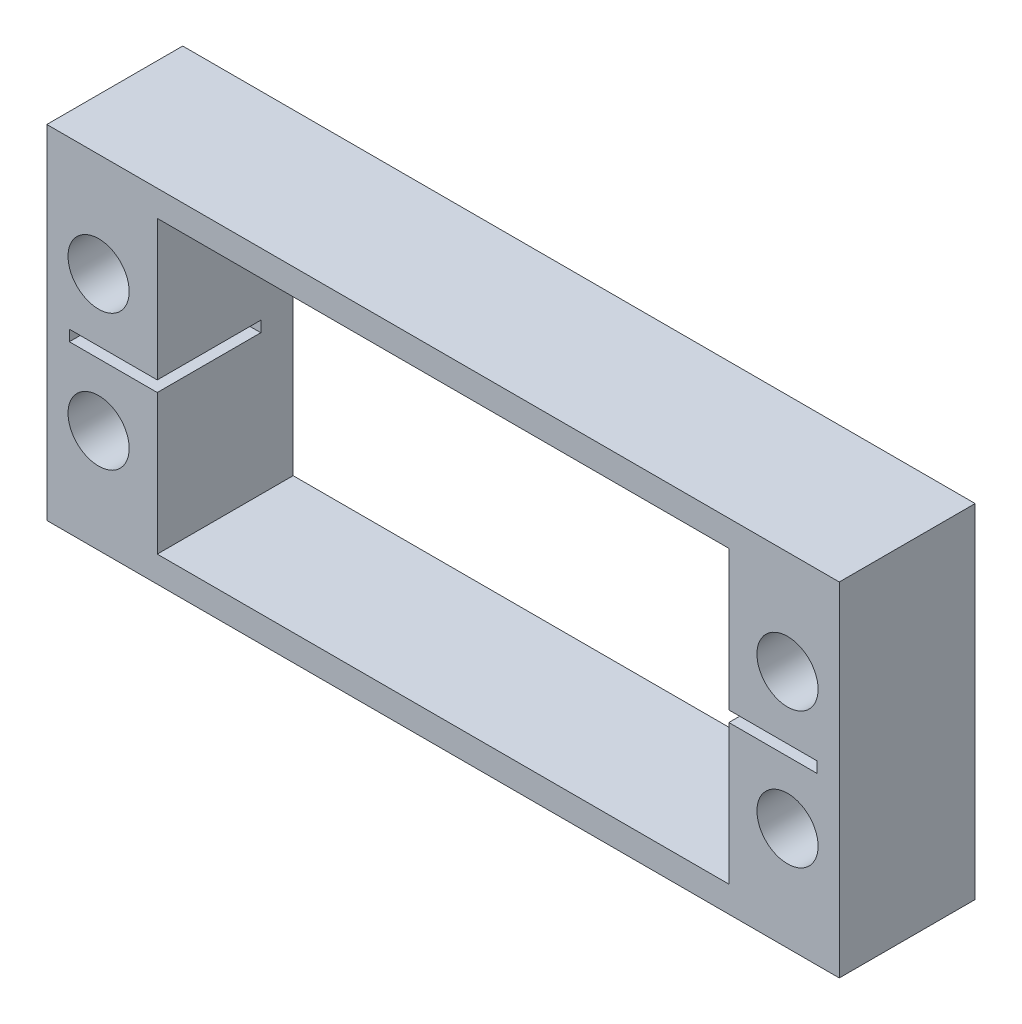
ISO-10303-21;
HEADER;
FILE_DESCRIPTION(('STEP AP214'),'2;1');
FILE_NAME('part.step','',(''),(''),'','','');
FILE_SCHEMA(('AUTOMOTIVE_DESIGN { 1 0 10303 214 1 1 1 1 }'));
ENDSEC;
DATA;
#1=APPLICATION_CONTEXT('core data for automotive mechanical design processes');
#2=APPLICATION_PROTOCOL_DEFINITION('international standard','automotive_design',2000,#1);
#3=PRODUCT_CONTEXT('',#1,'mechanical');
#4=PRODUCT('Part','Part','',(#3));
#5=PRODUCT_RELATED_PRODUCT_CATEGORY('part','',(#4));
#6=PRODUCT_DEFINITION_FORMATION('','',#4);
#7=PRODUCT_DEFINITION_CONTEXT('part definition',#1,'design');
#8=PRODUCT_DEFINITION('design','',#6,#7);
#9=PRODUCT_DEFINITION_SHAPE('','',#8);
#10=(LENGTH_UNIT() NAMED_UNIT(*) SI_UNIT(.MILLI.,.METRE.));
#11=(NAMED_UNIT(*) PLANE_ANGLE_UNIT() SI_UNIT($,.RADIAN.));
#12=(NAMED_UNIT(*) SI_UNIT($,.STERADIAN.) SOLID_ANGLE_UNIT());
#13=UNCERTAINTY_MEASURE_WITH_UNIT(LENGTH_MEASURE(1.E-05),#10,'distance_accuracy_value','');
#14=(GEOMETRIC_REPRESENTATION_CONTEXT(3) GLOBAL_UNCERTAINTY_ASSIGNED_CONTEXT((#13)) GLOBAL_UNIT_ASSIGNED_CONTEXT((#10,
#11,#12)) REPRESENTATION_CONTEXT('',''));
#15=CARTESIAN_POINT('',(0.,0.,0.));
#16=DIRECTION('',(0.,0.,1.));
#17=DIRECTION('',(1.,0.,0.));
#18=AXIS2_PLACEMENT_3D('',#15,#16,#17);
#19=CARTESIAN_POINT('',(0.,0.,5.));
#20=DIRECTION('',(0.,0.,1.));
#21=DIRECTION('',(1.,0.,0.));
#22=AXIS2_PLACEMENT_3D('',#19,#20,#21);
#23=PLANE('',#22);
#24=CARTESIAN_POINT('',(75.7720248017418,28.939282452646,5.));
#25=DIRECTION('',(0.,0.,1.));
#26=DIRECTION('',(1.,0.,0.));
#27=AXIS2_PLACEMENT_3D('',#24,#25,#26);
#28=CIRCLE('',#27,2.24999999993902);
#29=CARTESIAN_POINT('',(78.0220248016808,28.939282452646,5.));
#30=VERTEX_POINT('',#29);
#31=EDGE_CURVE('E258',#30,#30,#28,.T.);
#32=ORIENTED_EDGE('',*,*,#31,.F.);
#33=EDGE_LOOP('',(#32));
#34=FACE_BOUND('',#33,.T.);
#35=CARTESIAN_POINT('',(75.772021234631,38.9392642723775,5.));
#36=DIRECTION('',(0.,0.,1.));
#37=DIRECTION('',(1.,0.,0.));
#38=AXIS2_PLACEMENT_3D('',#35,#36,#37);
#39=CIRCLE('',#38,2.25001852691126);
#40=CARTESIAN_POINT('',(78.0220397615423,38.9392642723775,5.));
#41=VERTEX_POINT('',#40);
#42=EDGE_CURVE('E251',#41,#41,#39,.T.);
#43=ORIENTED_EDGE('',*,*,#42,.F.);
#44=EDGE_LOOP('',(#43));
#45=FACE_BOUND('',#44,.T.);
#46=CARTESIAN_POINT('',(25.0720248017418,38.939282452646,5.));
#47=DIRECTION('',(0.,0.,1.));
#48=DIRECTION('',(1.,0.,0.));
#49=AXIS2_PLACEMENT_3D('',#46,#47,#48);
#50=CIRCLE('',#49,2.25000000226119);
#51=CARTESIAN_POINT('',(27.322024804003,38.939282452646,5.));
#52=VERTEX_POINT('',#51);
#53=EDGE_CURVE('E250',#52,#52,#50,.T.);
#54=ORIENTED_EDGE('',*,*,#53,.F.);
#55=EDGE_LOOP('',(#54));
#56=FACE_BOUND('',#55,.T.);
#57=CARTESIAN_POINT('',(25.0720248017418,28.939282452646,5.));
#58=DIRECTION('',(0.,0.,1.));
#59=DIRECTION('',(1.,0.,0.));
#60=AXIS2_PLACEMENT_3D('',#57,#58,#59);
#61=CIRCLE('',#60,2.2499999996299);
#62=CARTESIAN_POINT('',(27.3220248013717,28.939282452646,5.));
#63=VERTEX_POINT('',#62);
#64=EDGE_CURVE('E267',#63,#63,#61,.T.);
#65=ORIENTED_EDGE('',*,*,#64,.F.);
#66=EDGE_LOOP('',(#65));
#67=FACE_BOUND('',#66,.T.);
#68=DIRECTION('',(0.,-1.,0.));
#69=VECTOR('',#68,1.);
#70=CARTESIAN_POINT('',(21.2620248017418,46.559282452646,5.));
#71=LINE('',#70,#69);
#72=CARTESIAN_POINT('',(21.2620248017418,46.559282452646,5.));
#73=VERTEX_POINT('',#72);
#74=CARTESIAN_POINT('',(21.2620248017418,21.319282452646,5.));
#75=VERTEX_POINT('',#74);
#76=EDGE_CURVE('E271',#73,#75,#71,.T.);
#77=ORIENTED_EDGE('',*,*,#76,.T.);
#78=DIRECTION('',(1.,0.,0.));
#79=VECTOR('',#78,1.);
#80=CARTESIAN_POINT('',(21.2620248017418,21.319282452646,5.));
#81=LINE('',#80,#79);
#82=CARTESIAN_POINT('',(79.5820248017418,21.319282452646,5.));
#83=VERTEX_POINT('',#82);
#84=EDGE_CURVE('E274',#75,#83,#81,.T.);
#85=ORIENTED_EDGE('',*,*,#84,.T.);
#86=DIRECTION('',(0.,1.,0.));
#87=VECTOR('',#86,1.);
#88=CARTESIAN_POINT('',(79.5820248017418,46.559282452646,5.));
#89=LINE('',#88,#87);
#90=CARTESIAN_POINT('',(79.5820248017418,46.559282452646,5.));
#91=VERTEX_POINT('',#90);
#92=EDGE_CURVE('E277',#83,#91,#89,.T.);
#93=ORIENTED_EDGE('',*,*,#92,.T.);
#94=DIRECTION('',(-1.,0.,0.));
#95=VECTOR('',#94,1.);
#96=CARTESIAN_POINT('',(21.2620248017418,46.559282452646,5.));
#97=LINE('',#96,#95);
#98=EDGE_CURVE('E279',#91,#73,#97,.T.);
#99=ORIENTED_EDGE('',*,*,#98,.T.);
#100=EDGE_LOOP('',(#77,#85,#93,#99));
#101=FACE_BOUND('',#100,.T.);
#102=DIRECTION('',(0.,1.,0.));
#103=VECTOR('',#102,1.);
#104=CARTESIAN_POINT('',(71.454021234631,0.,5.));
#105=LINE('',#104,#103);
#106=CARTESIAN_POINT('',(71.454021234631,34.339282452646,5.));
#107=VERTEX_POINT('',#106);
#108=CARTESIAN_POINT('',(71.454021234631,44.639282452646,5.));
#109=VERTEX_POINT('',#108);
#110=EDGE_CURVE('E236',#107,#109,#105,.T.);
#111=ORIENTED_EDGE('',*,*,#110,.F.);
#112=DIRECTION('',(1.,0.,0.));
#113=VECTOR('',#112,1.);
#114=CARTESIAN_POINT('',(77.924021234631,34.339282452646,5.));
#115=LINE('',#114,#113);
#116=CARTESIAN_POINT('',(77.924021234631,34.339282452646,5.));
#117=VERTEX_POINT('',#116);
#118=EDGE_CURVE('E176',#107,#117,#115,.T.);
#119=ORIENTED_EDGE('',*,*,#118,.T.);
#120=DIRECTION('',(0.,-1.,0.));
#121=VECTOR('',#120,1.);
#122=CARTESIAN_POINT('',(77.924021234631,33.539282452646,5.));
#123=LINE('',#122,#121);
#124=CARTESIAN_POINT('',(77.924021234631,33.539282452646,5.));
#125=VERTEX_POINT('',#124);
#126=EDGE_CURVE('E164',#117,#125,#123,.T.);
#127=ORIENTED_EDGE('',*,*,#126,.T.);
#128=DIRECTION('',(-1.,0.,0.));
#129=VECTOR('',#128,1.);
#130=CARTESIAN_POINT('',(77.924021234631,33.539282452646,5.));
#131=LINE('',#130,#129);
#132=CARTESIAN_POINT('',(71.454021234631,33.539282452646,5.));
#133=VERTEX_POINT('',#132);
#134=EDGE_CURVE('E179',#125,#133,#131,.T.);
#135=ORIENTED_EDGE('',*,*,#134,.T.);
#136=CARTESIAN_POINT('',(71.454021234631,23.239282422646,5.));
#137=VERTEX_POINT('',#136);
#138=EDGE_CURVE('E237',#137,#133,#105,.T.);
#139=ORIENTED_EDGE('',*,*,#138,.F.);
#140=DIRECTION('',(1.,0.,0.));
#141=VECTOR('',#140,1.);
#142=CARTESIAN_POINT('',(0.,23.239282422646,5.));
#143=LINE('',#142,#141);
#144=CARTESIAN_POINT('',(29.3900248017418,23.239282422646,5.));
#145=VERTEX_POINT('',#144);
#146=EDGE_CURVE('E226',#145,#137,#143,.T.);
#147=ORIENTED_EDGE('',*,*,#146,.F.);
#148=DIRECTION('',(0.,-1.,0.));
#149=VECTOR('',#148,1.);
#150=CARTESIAN_POINT('',(29.3900248017418,0.,5.));
#151=LINE('',#150,#149);
#152=CARTESIAN_POINT('',(29.3900248017418,33.539282452646,5.));
#153=VERTEX_POINT('',#152);
#154=EDGE_CURVE('E242',#153,#145,#151,.T.);
#155=ORIENTED_EDGE('',*,*,#154,.F.);
#156=DIRECTION('',(-1.,0.,0.));
#157=VECTOR('',#156,1.);
#158=CARTESIAN_POINT('',(22.9200248017418,33.539282452646,5.));
#159=LINE('',#158,#157);
#160=CARTESIAN_POINT('',(22.9200248017418,33.539282452646,5.));
#161=VERTEX_POINT('',#160);
#162=EDGE_CURVE('E197',#153,#161,#159,.T.);
#163=ORIENTED_EDGE('',*,*,#162,.T.);
#164=DIRECTION('',(0.,1.,0.));
#165=VECTOR('',#164,1.);
#166=CARTESIAN_POINT('',(22.9200248017418,33.539282452646,5.));
#167=LINE('',#166,#165);
#168=CARTESIAN_POINT('',(22.9200248017418,34.339282452646,5.));
#169=VERTEX_POINT('',#168);
#170=EDGE_CURVE('E200',#161,#169,#167,.T.);
#171=ORIENTED_EDGE('',*,*,#170,.T.);
#172=DIRECTION('',(1.,0.,0.));
#173=VECTOR('',#172,1.);
#174=CARTESIAN_POINT('',(22.9200248017418,34.339282452646,5.));
#175=LINE('',#174,#173);
#176=CARTESIAN_POINT('',(29.3900248017418,34.339282452646,5.));
#177=VERTEX_POINT('',#176);
#178=EDGE_CURVE('E190',#169,#177,#175,.T.);
#179=ORIENTED_EDGE('',*,*,#178,.T.);
#180=CARTESIAN_POINT('',(29.3900248017418,44.639282452646,5.));
#181=VERTEX_POINT('',#180);
#182=EDGE_CURVE('E243',#181,#177,#151,.T.);
#183=ORIENTED_EDGE('',*,*,#182,.F.);
#184=DIRECTION('',(-1.,0.,0.));
#185=VECTOR('',#184,1.);
#186=CARTESIAN_POINT('',(0.,44.639282452646,5.));
#187=LINE('',#186,#185);
#188=EDGE_CURVE('E240',#109,#181,#187,.T.);
#189=ORIENTED_EDGE('',*,*,#188,.F.);
#190=EDGE_LOOP('',(#111,#119,#127,#135,#139,#147,#155,#163,#171,#179,#183,#189));
#191=FACE_BOUND('',#190,.T.);
#192=ADVANCED_FACE('F38',(#34,#45,#56,#67,#101,#191),#23,.T.);
#193=CARTESIAN_POINT('',(29.3900248017418,44.639282452646,-5.));
#194=DIRECTION('',(-1.,0.,0.));
#195=DIRECTION('',(0.,-1.,0.));
#196=AXIS2_PLACEMENT_3D('',#193,#194,#195);
#197=PLANE('',#196);
#198=DIRECTION('',(0.,0.,1.));
#199=VECTOR('',#198,1.);
#200=CARTESIAN_POINT('',(29.3900248017418,33.539282452646,-2.62));
#201=LINE('',#200,#199);
#202=CARTESIAN_POINT('',(29.3900248017418,33.539282452646,-2.62));
#203=VERTEX_POINT('',#202);
#204=EDGE_CURVE('E53',#203,#153,#201,.T.);
#205=ORIENTED_EDGE('',*,*,#204,.T.);
#206=ORIENTED_EDGE('',*,*,#154,.T.);
#207=DIRECTION('',(0.,0.,1.));
#208=VECTOR('',#207,1.);
#209=CARTESIAN_POINT('',(29.3900248017418,23.239282422646,-5.));
#210=LINE('',#209,#208);
#211=CARTESIAN_POINT('',(29.3900248017418,23.239282422646,-5.));
#212=VERTEX_POINT('',#211);
#213=EDGE_CURVE('E222',#212,#145,#210,.T.);
#214=ORIENTED_EDGE('',*,*,#213,.F.);
#215=DIRECTION('',(0.,-1.,0.));
#216=VECTOR('',#215,1.);
#217=CARTESIAN_POINT('',(29.3900248017418,44.639282452646,-5.));
#218=LINE('',#217,#216);
#219=CARTESIAN_POINT('',(29.3900248017418,44.639282452646,-5.));
#220=VERTEX_POINT('',#219);
#221=EDGE_CURVE('E185',#220,#212,#218,.T.);
#222=ORIENTED_EDGE('',*,*,#221,.F.);
#223=DIRECTION('',(0.,0.,1.));
#224=VECTOR('',#223,1.);
#225=CARTESIAN_POINT('',(29.3900248017418,44.639282452646,-5.));
#226=LINE('',#225,#224);
#227=EDGE_CURVE('E223',#220,#181,#226,.T.);
#228=ORIENTED_EDGE('',*,*,#227,.T.);
#229=ORIENTED_EDGE('',*,*,#182,.T.);
#230=DIRECTION('',(0.,0.,1.));
#231=VECTOR('',#230,1.);
#232=CARTESIAN_POINT('',(29.3900248017418,34.339282452646,-2.62));
#233=LINE('',#232,#231);
#234=CARTESIAN_POINT('',(29.3900248017418,34.339282452646,-2.62));
#235=VERTEX_POINT('',#234);
#236=EDGE_CURVE('E196',#235,#177,#233,.T.);
#237=ORIENTED_EDGE('',*,*,#236,.F.);
#238=DIRECTION('',(0.,-1.,0.));
#239=VECTOR('',#238,1.);
#240=CARTESIAN_POINT('',(29.3900248017418,33.539282452646,-2.62));
#241=LINE('',#240,#239);
#242=EDGE_CURVE('E186',#235,#203,#241,.T.);
#243=ORIENTED_EDGE('',*,*,#242,.T.);
#244=EDGE_LOOP('',(#205,#206,#214,#222,#228,#229,#237,#243));
#245=FACE_BOUND('',#244,.T.);
#246=ADVANCED_FACE('F323',(#245),#197,.F.);
#247=CARTESIAN_POINT('',(71.454021234631,44.639282452646,-5.));
#248=DIRECTION('',(1.,0.,0.));
#249=DIRECTION('',(0.,0.,-1.));
#250=AXIS2_PLACEMENT_3D('',#247,#248,#249);
#251=PLANE('',#250);
#252=DIRECTION('',(0.,0.,1.));
#253=VECTOR('',#252,1.);
#254=CARTESIAN_POINT('',(71.454021234631,34.339282452646,-2.62));
#255=LINE('',#254,#253);
#256=CARTESIAN_POINT('',(71.454021234631,34.339282452646,-2.62));
#257=VERTEX_POINT('',#256);
#258=EDGE_CURVE('E61',#257,#107,#255,.T.);
#259=ORIENTED_EDGE('',*,*,#258,.T.);
#260=ORIENTED_EDGE('',*,*,#110,.T.);
#261=DIRECTION('',(0.,0.,1.));
#262=VECTOR('',#261,1.);
#263=CARTESIAN_POINT('',(71.454021234631,44.639282452646,-5.));
#264=LINE('',#263,#262);
#265=CARTESIAN_POINT('',(71.454021234631,44.639282452646,-5.));
#266=VERTEX_POINT('',#265);
#267=EDGE_CURVE('E227',#266,#109,#264,.T.);
#268=ORIENTED_EDGE('',*,*,#267,.F.);
#269=DIRECTION('',(0.,1.,0.));
#270=VECTOR('',#269,1.);
#271=CARTESIAN_POINT('',(71.454021234631,44.639282452646,-5.));
#272=LINE('',#271,#270);
#273=CARTESIAN_POINT('',(71.454021234631,23.239282422646,-5.));
#274=VERTEX_POINT('',#273);
#275=EDGE_CURVE('E216',#274,#266,#272,.T.);
#276=ORIENTED_EDGE('',*,*,#275,.F.);
#277=DIRECTION('',(0.,0.,1.));
#278=VECTOR('',#277,1.);
#279=CARTESIAN_POINT('',(71.454021234631,23.239282422646,-5.));
#280=LINE('',#279,#278);
#281=EDGE_CURVE('E230',#274,#137,#280,.T.);
#282=ORIENTED_EDGE('',*,*,#281,.T.);
#283=ORIENTED_EDGE('',*,*,#138,.T.);
#284=DIRECTION('',(0.,0.,1.));
#285=VECTOR('',#284,1.);
#286=CARTESIAN_POINT('',(71.454021234631,33.539282452646,-2.62));
#287=LINE('',#286,#285);
#288=CARTESIAN_POINT('',(71.454021234631,33.539282452646,-2.62));
#289=VERTEX_POINT('',#288);
#290=EDGE_CURVE('E172',#289,#133,#287,.T.);
#291=ORIENTED_EDGE('',*,*,#290,.F.);
#292=DIRECTION('',(0.,1.,0.));
#293=VECTOR('',#292,1.);
#294=CARTESIAN_POINT('',(71.454021234631,33.539282452646,-2.62));
#295=LINE('',#294,#293);
#296=EDGE_CURVE('E158',#289,#257,#295,.T.);
#297=ORIENTED_EDGE('',*,*,#296,.T.);
#298=EDGE_LOOP('',(#259,#260,#268,#276,#282,#283,#291,#297));
#299=FACE_BOUND('',#298,.T.);
#300=ADVANCED_FACE('F321',(#299),#251,.F.);
#301=CARTESIAN_POINT('',(21.2620248017418,46.559282452646,5.));
#302=DIRECTION('',(1.,0.,0.));
#303=DIRECTION('',(0.,1.,0.));
#304=AXIS2_PLACEMENT_3D('',#301,#302,#303);
#305=PLANE('',#304);
#306=DIRECTION('',(0.,-1.,0.));
#307=VECTOR('',#306,1.);
#308=CARTESIAN_POINT('',(21.2620248017418,46.559282452646,-5.));
#309=LINE('',#308,#307);
#310=CARTESIAN_POINT('',(21.2620248017418,46.559282452646,-5.));
#311=VERTEX_POINT('',#310);
#312=CARTESIAN_POINT('',(21.2620248017418,21.319282452646,-5.));
#313=VERTEX_POINT('',#312);
#314=EDGE_CURVE('E270',#311,#313,#309,.T.);
#315=ORIENTED_EDGE('',*,*,#314,.T.);
#316=DIRECTION('',(0.,0.,-1.));
#317=VECTOR('',#316,1.);
#318=CARTESIAN_POINT('',(21.2620248017418,21.319282452646,5.));
#319=LINE('',#318,#317);
#320=EDGE_CURVE('E11',#75,#313,#319,.T.);
#321=ORIENTED_EDGE('',*,*,#320,.F.);
#322=ORIENTED_EDGE('',*,*,#76,.F.);
#323=DIRECTION('',(0.,0.,-1.));
#324=VECTOR('',#323,1.);
#325=CARTESIAN_POINT('',(21.2620248017418,46.559282452646,5.));
#326=LINE('',#325,#324);
#327=EDGE_CURVE('E281',#73,#311,#326,.T.);
#328=ORIENTED_EDGE('',*,*,#327,.T.);
#329=EDGE_LOOP('',(#315,#321,#322,#328));
#330=FACE_BOUND('',#329,.T.);
#331=ADVANCED_FACE('F40',(#330),#305,.F.);
#332=CARTESIAN_POINT('',(21.2620248017418,21.319282452646,5.));
#333=DIRECTION('',(0.,1.,0.));
#334=DIRECTION('',(0.,0.,1.));
#335=AXIS2_PLACEMENT_3D('',#332,#333,#334);
#336=PLANE('',#335);
#337=DIRECTION('',(1.,0.,0.));
#338=VECTOR('',#337,1.);
#339=CARTESIAN_POINT('',(21.2620248017418,21.319282452646,-5.));
#340=LINE('',#339,#338);
#341=CARTESIAN_POINT('',(79.5820248017418,21.319282452646,-5.));
#342=VERTEX_POINT('',#341);
#343=EDGE_CURVE('E284',#313,#342,#340,.T.);
#344=ORIENTED_EDGE('',*,*,#343,.T.);
#345=DIRECTION('',(0.,0.,-1.));
#346=VECTOR('',#345,1.);
#347=CARTESIAN_POINT('',(79.5820248017418,21.319282452646,5.));
#348=LINE('',#347,#346);
#349=EDGE_CURVE('E46',#83,#342,#348,.T.);
#350=ORIENTED_EDGE('',*,*,#349,.F.);
#351=ORIENTED_EDGE('',*,*,#84,.F.);
#352=ORIENTED_EDGE('',*,*,#320,.T.);
#353=EDGE_LOOP('',(#344,#350,#351,#352));
#354=FACE_BOUND('',#353,.T.);
#355=ADVANCED_FACE('F314',(#354),#336,.F.);
#356=CARTESIAN_POINT('',(79.5820248017418,46.559282452646,5.));
#357=DIRECTION('',(-1.,0.,0.));
#358=DIRECTION('',(0.,0.,1.));
#359=AXIS2_PLACEMENT_3D('',#356,#357,#358);
#360=PLANE('',#359);
#361=DIRECTION('',(0.,1.,0.));
#362=VECTOR('',#361,1.);
#363=CARTESIAN_POINT('',(79.5820248017418,46.559282452646,-5.));
#364=LINE('',#363,#362);
#365=CARTESIAN_POINT('',(79.5820248017418,46.559282452646,-5.));
#366=VERTEX_POINT('',#365);
#367=EDGE_CURVE('E286',#342,#366,#364,.T.);
#368=ORIENTED_EDGE('',*,*,#367,.T.);
#369=DIRECTION('',(0.,0.,-1.));
#370=VECTOR('',#369,1.);
#371=CARTESIAN_POINT('',(79.5820248017418,46.559282452646,5.));
#372=LINE('',#371,#370);
#373=EDGE_CURVE('E291',#91,#366,#372,.T.);
#374=ORIENTED_EDGE('',*,*,#373,.F.);
#375=ORIENTED_EDGE('',*,*,#92,.F.);
#376=ORIENTED_EDGE('',*,*,#349,.T.);
#377=EDGE_LOOP('',(#368,#374,#375,#376));
#378=FACE_BOUND('',#377,.T.);
#379=ADVANCED_FACE('F298',(#378),#360,.F.);
#380=CARTESIAN_POINT('',(21.2620248017418,46.559282452646,5.));
#381=DIRECTION('',(0.,-1.,0.));
#382=DIRECTION('',(0.,0.,-1.));
#383=AXIS2_PLACEMENT_3D('',#380,#381,#382);
#384=PLANE('',#383);
#385=DIRECTION('',(-1.,0.,0.));
#386=VECTOR('',#385,1.);
#387=CARTESIAN_POINT('',(21.2620248017418,46.559282452646,-5.));
#388=LINE('',#387,#386);
#389=EDGE_CURVE('E275',#366,#311,#388,.T.);
#390=ORIENTED_EDGE('',*,*,#389,.T.);
#391=ORIENTED_EDGE('',*,*,#327,.F.);
#392=ORIENTED_EDGE('',*,*,#98,.F.);
#393=ORIENTED_EDGE('',*,*,#373,.T.);
#394=EDGE_LOOP('',(#390,#391,#392,#393));
#395=FACE_BOUND('',#394,.T.);
#396=ADVANCED_FACE('F307',(#395),#384,.F.);
#397=CARTESIAN_POINT('',(0.,0.,-5.));
#398=DIRECTION('',(0.,0.,1.));
#399=DIRECTION('',(1.,0.,0.));
#400=AXIS2_PLACEMENT_3D('',#397,#398,#399);
#401=PLANE('',#400);
#402=DIRECTION('',(-1.,0.,0.));
#403=VECTOR('',#402,1.);
#404=CARTESIAN_POINT('',(29.3900248017418,44.639282452646,-5.));
#405=LINE('',#404,#403);
#406=EDGE_CURVE('E219',#266,#220,#405,.T.);
#407=ORIENTED_EDGE('',*,*,#406,.T.);
#408=ORIENTED_EDGE('',*,*,#221,.T.);
#409=DIRECTION('',(1.,0.,0.));
#410=VECTOR('',#409,1.);
#411=CARTESIAN_POINT('',(29.3900248017418,23.239282422646,-5.));
#412=LINE('',#411,#410);
#413=EDGE_CURVE('E213',#212,#274,#412,.T.);
#414=ORIENTED_EDGE('',*,*,#413,.T.);
#415=ORIENTED_EDGE('',*,*,#275,.T.);
#416=EDGE_LOOP('',(#407,#408,#414,#415));
#417=FACE_BOUND('',#416,.T.);
#418=CARTESIAN_POINT('',(75.7720248017418,28.939282452646,-5.));
#419=DIRECTION('',(0.,0.,1.));
#420=DIRECTION('',(1.,0.,0.));
#421=AXIS2_PLACEMENT_3D('',#418,#419,#420);
#422=CIRCLE('',#421,2.24999999993902);
#423=CARTESIAN_POINT('',(78.0220248016808,28.939282452646,-5.));
#424=VERTEX_POINT('',#423);
#425=EDGE_CURVE('E246',#424,#424,#422,.T.);
#426=ORIENTED_EDGE('',*,*,#425,.T.);
#427=EDGE_LOOP('',(#426));
#428=FACE_BOUND('',#427,.T.);
#429=CARTESIAN_POINT('',(75.772021234631,38.9392642723775,-5.));
#430=DIRECTION('',(0.,0.,1.));
#431=DIRECTION('',(1.,0.,0.));
#432=AXIS2_PLACEMENT_3D('',#429,#430,#431);
#433=CIRCLE('',#432,2.25001852691126);
#434=CARTESIAN_POINT('',(78.0220397615423,38.9392642723775,-5.));
#435=VERTEX_POINT('',#434);
#436=EDGE_CURVE('E255',#435,#435,#433,.T.);
#437=ORIENTED_EDGE('',*,*,#436,.T.);
#438=EDGE_LOOP('',(#437));
#439=FACE_BOUND('',#438,.T.);
#440=CARTESIAN_POINT('',(25.0720248017418,38.939282452646,-5.));
#441=DIRECTION('',(0.,0.,1.));
#442=DIRECTION('',(1.,0.,0.));
#443=AXIS2_PLACEMENT_3D('',#440,#441,#442);
#444=CIRCLE('',#443,2.25000000226119);
#445=CARTESIAN_POINT('',(27.322024804003,38.939282452646,-5.));
#446=VERTEX_POINT('',#445);
#447=EDGE_CURVE('E247',#446,#446,#444,.T.);
#448=ORIENTED_EDGE('',*,*,#447,.T.);
#449=EDGE_LOOP('',(#448));
#450=FACE_BOUND('',#449,.T.);
#451=CARTESIAN_POINT('',(25.0720248017418,28.939282452646,-5.));
#452=DIRECTION('',(0.,0.,1.));
#453=DIRECTION('',(1.,0.,0.));
#454=AXIS2_PLACEMENT_3D('',#451,#452,#453);
#455=CIRCLE('',#454,2.2499999996299);
#456=CARTESIAN_POINT('',(27.3220248013717,28.939282452646,-5.));
#457=VERTEX_POINT('',#456);
#458=EDGE_CURVE('E254',#457,#457,#455,.T.);
#459=ORIENTED_EDGE('',*,*,#458,.T.);
#460=EDGE_LOOP('',(#459));
#461=FACE_BOUND('',#460,.T.);
#462=ORIENTED_EDGE('',*,*,#314,.F.);
#463=ORIENTED_EDGE('',*,*,#389,.F.);
#464=ORIENTED_EDGE('',*,*,#367,.F.);
#465=ORIENTED_EDGE('',*,*,#343,.F.);
#466=EDGE_LOOP('',(#462,#463,#464,#465));
#467=FACE_BOUND('',#466,.T.);
#468=ADVANCED_FACE('F304',(#417,#428,#439,#450,#461,#467),#401,.F.);
#469=CARTESIAN_POINT('',(25.0720248017418,28.939282452646,5.));
#470=DIRECTION('',(0.,0.,-1.));
#471=DIRECTION('',(-1.,0.,0.));
#472=AXIS2_PLACEMENT_3D('',#469,#470,#471);
#473=CYLINDRICAL_SURFACE('',#472,2.2499999996299);
#474=ORIENTED_EDGE('',*,*,#64,.T.);
#475=EDGE_LOOP('',(#474));
#476=FACE_BOUND('',#475,.T.);
#477=ORIENTED_EDGE('',*,*,#458,.F.);
#478=EDGE_LOOP('',(#477));
#479=FACE_BOUND('',#478,.T.);
#480=ADVANCED_FACE('F335',(#476,#479),#473,.F.);
#481=CARTESIAN_POINT('',(25.0720248017418,38.939282452646,5.));
#482=DIRECTION('',(0.,0.,-1.));
#483=DIRECTION('',(-1.,0.,0.));
#484=AXIS2_PLACEMENT_3D('',#481,#482,#483);
#485=CYLINDRICAL_SURFACE('',#484,2.25000000226119);
#486=ORIENTED_EDGE('',*,*,#53,.T.);
#487=EDGE_LOOP('',(#486));
#488=FACE_BOUND('',#487,.T.);
#489=ORIENTED_EDGE('',*,*,#447,.F.);
#490=EDGE_LOOP('',(#489));
#491=FACE_BOUND('',#490,.T.);
#492=ADVANCED_FACE('F357',(#488,#491),#485,.F.);
#493=CARTESIAN_POINT('',(75.772021234631,38.9392642723775,5.));
#494=DIRECTION('',(0.,0.,-1.));
#495=DIRECTION('',(-1.,0.,0.));
#496=AXIS2_PLACEMENT_3D('',#493,#494,#495);
#497=CYLINDRICAL_SURFACE('',#496,2.25001852691126);
#498=ORIENTED_EDGE('',*,*,#42,.T.);
#499=EDGE_LOOP('',(#498));
#500=FACE_BOUND('',#499,.T.);
#501=ORIENTED_EDGE('',*,*,#436,.F.);
#502=EDGE_LOOP('',(#501));
#503=FACE_BOUND('',#502,.T.);
#504=ADVANCED_FACE('F364',(#500,#503),#497,.F.);
#505=CARTESIAN_POINT('',(75.7720248017418,28.939282452646,5.));
#506=DIRECTION('',(0.,0.,-1.));
#507=DIRECTION('',(-1.,0.,0.));
#508=AXIS2_PLACEMENT_3D('',#505,#506,#507);
#509=CYLINDRICAL_SURFACE('',#508,2.24999999993902);
#510=ORIENTED_EDGE('',*,*,#31,.T.);
#511=EDGE_LOOP('',(#510));
#512=FACE_BOUND('',#511,.T.);
#513=ORIENTED_EDGE('',*,*,#425,.F.);
#514=EDGE_LOOP('',(#513));
#515=FACE_BOUND('',#514,.T.);
#516=ADVANCED_FACE('F372',(#512,#515),#509,.F.);
#517=CARTESIAN_POINT('',(29.3900248017418,44.639282452646,-5.));
#518=DIRECTION('',(0.,1.,0.));
#519=DIRECTION('',(0.,0.,1.));
#520=AXIS2_PLACEMENT_3D('',#517,#518,#519);
#521=PLANE('',#520);
#522=ORIENTED_EDGE('',*,*,#188,.T.);
#523=ORIENTED_EDGE('',*,*,#227,.F.);
#524=ORIENTED_EDGE('',*,*,#406,.F.);
#525=ORIENTED_EDGE('',*,*,#267,.T.);
#526=EDGE_LOOP('',(#522,#523,#524,#525));
#527=FACE_BOUND('',#526,.T.);
#528=ADVANCED_FACE('F379',(#527),#521,.F.);
#529=CARTESIAN_POINT('',(29.3900248017418,23.239282422646,-5.));
#530=DIRECTION('',(0.,-1.,0.));
#531=DIRECTION('',(0.,0.,-1.));
#532=AXIS2_PLACEMENT_3D('',#529,#530,#531);
#533=PLANE('',#532);
#534=ORIENTED_EDGE('',*,*,#146,.T.);
#535=ORIENTED_EDGE('',*,*,#281,.F.);
#536=ORIENTED_EDGE('',*,*,#413,.F.);
#537=ORIENTED_EDGE('',*,*,#213,.T.);
#538=EDGE_LOOP('',(#534,#535,#536,#537));
#539=FACE_BOUND('',#538,.T.);
#540=ADVANCED_FACE('F385',(#539),#533,.F.);
#541=CARTESIAN_POINT('',(77.924021234631,34.339282452646,-2.62));
#542=DIRECTION('',(0.,-1.,0.));
#543=DIRECTION('',(0.,0.,-1.));
#544=AXIS2_PLACEMENT_3D('',#541,#542,#543);
#545=PLANE('',#544);
#546=ORIENTED_EDGE('',*,*,#118,.F.);
#547=ORIENTED_EDGE('',*,*,#258,.F.);
#548=DIRECTION('',(1.,0.,0.));
#549=VECTOR('',#548,1.);
#550=CARTESIAN_POINT('',(77.924021234631,34.339282452646,-2.62));
#551=LINE('',#550,#549);
#552=CARTESIAN_POINT('',(77.924021234631,34.339282452646,-2.62));
#553=VERTEX_POINT('',#552);
#554=EDGE_CURVE('E148',#257,#553,#551,.T.);
#555=ORIENTED_EDGE('',*,*,#554,.T.);
#556=DIRECTION('',(0.,0.,1.));
#557=VECTOR('',#556,1.);
#558=CARTESIAN_POINT('',(77.924021234631,34.339282452646,-2.62));
#559=LINE('',#558,#557);
#560=EDGE_CURVE('E151',#553,#117,#559,.T.);
#561=ORIENTED_EDGE('',*,*,#560,.T.);
#562=EDGE_LOOP('',(#546,#547,#555,#561));
#563=FACE_BOUND('',#562,.T.);
#564=ADVANCED_FACE('F150',(#563),#545,.T.);
#565=CARTESIAN_POINT('',(77.924021234631,33.539282452646,-2.62));
#566=DIRECTION('',(-1.,0.,0.));
#567=DIRECTION('',(0.,0.,1.));
#568=AXIS2_PLACEMENT_3D('',#565,#566,#567);
#569=PLANE('',#568);
#570=ORIENTED_EDGE('',*,*,#126,.F.);
#571=ORIENTED_EDGE('',*,*,#560,.F.);
#572=DIRECTION('',(0.,-1.,0.));
#573=VECTOR('',#572,1.);
#574=CARTESIAN_POINT('',(77.924021234631,33.539282452646,-2.62));
#575=LINE('',#574,#573);
#576=CARTESIAN_POINT('',(77.924021234631,33.539282452646,-2.62));
#577=VERTEX_POINT('',#576);
#578=EDGE_CURVE('E157',#553,#577,#575,.T.);
#579=ORIENTED_EDGE('',*,*,#578,.T.);
#580=DIRECTION('',(0.,0.,1.));
#581=VECTOR('',#580,1.);
#582=CARTESIAN_POINT('',(77.924021234631,33.539282452646,-2.62));
#583=LINE('',#582,#581);
#584=EDGE_CURVE('E166',#577,#125,#583,.T.);
#585=ORIENTED_EDGE('',*,*,#584,.T.);
#586=EDGE_LOOP('',(#570,#571,#579,#585));
#587=FACE_BOUND('',#586,.T.);
#588=ADVANCED_FACE('F161',(#587),#569,.T.);
#589=CARTESIAN_POINT('',(77.924021234631,33.539282452646,-2.62));
#590=DIRECTION('',(0.,1.,0.));
#591=DIRECTION('',(0.,0.,1.));
#592=AXIS2_PLACEMENT_3D('',#589,#590,#591);
#593=PLANE('',#592);
#594=ORIENTED_EDGE('',*,*,#134,.F.);
#595=ORIENTED_EDGE('',*,*,#584,.F.);
#596=DIRECTION('',(-1.,0.,0.));
#597=VECTOR('',#596,1.);
#598=CARTESIAN_POINT('',(77.924021234631,33.539282452646,-2.62));
#599=LINE('',#598,#597);
#600=EDGE_CURVE('E170',#577,#289,#599,.T.);
#601=ORIENTED_EDGE('',*,*,#600,.T.);
#602=ORIENTED_EDGE('',*,*,#290,.T.);
#603=EDGE_LOOP('',(#594,#595,#601,#602));
#604=FACE_BOUND('',#603,.T.);
#605=ADVANCED_FACE('F407',(#604),#593,.T.);
#606=CARTESIAN_POINT('',(0.,0.,-2.62));
#607=DIRECTION('',(0.,0.,1.));
#608=DIRECTION('',(1.,0.,0.));
#609=AXIS2_PLACEMENT_3D('',#606,#607,#608);
#610=PLANE('',#609);
#611=ORIENTED_EDGE('',*,*,#296,.F.);
#612=ORIENTED_EDGE('',*,*,#600,.F.);
#613=ORIENTED_EDGE('',*,*,#578,.F.);
#614=ORIENTED_EDGE('',*,*,#554,.F.);
#615=EDGE_LOOP('',(#611,#612,#613,#614));
#616=FACE_BOUND('',#615,.T.);
#617=ADVANCED_FACE('F169',(#616),#610,.T.);
#618=CARTESIAN_POINT('',(22.9200248017418,33.539282452646,-2.62));
#619=DIRECTION('',(0.,1.,0.));
#620=DIRECTION('',(0.,0.,1.));
#621=AXIS2_PLACEMENT_3D('',#618,#619,#620);
#622=PLANE('',#621);
#623=ORIENTED_EDGE('',*,*,#162,.F.);
#624=ORIENTED_EDGE('',*,*,#204,.F.);
#625=DIRECTION('',(-1.,0.,0.));
#626=VECTOR('',#625,1.);
#627=CARTESIAN_POINT('',(22.9200248017418,33.539282452646,-2.62));
#628=LINE('',#627,#626);
#629=CARTESIAN_POINT('',(22.9200248017418,33.539282452646,-2.62));
#630=VERTEX_POINT('',#629);
#631=EDGE_CURVE('E189',#203,#630,#628,.T.);
#632=ORIENTED_EDGE('',*,*,#631,.T.);
#633=DIRECTION('',(0.,0.,1.));
#634=VECTOR('',#633,1.);
#635=CARTESIAN_POINT('',(22.9200248017418,33.539282452646,-2.62));
#636=LINE('',#635,#634);
#637=EDGE_CURVE('E208',#630,#161,#636,.T.);
#638=ORIENTED_EDGE('',*,*,#637,.T.);
#639=EDGE_LOOP('',(#623,#624,#632,#638));
#640=FACE_BOUND('',#639,.T.);
#641=ADVANCED_FACE('F421',(#640),#622,.T.);
#642=CARTESIAN_POINT('',(22.9200248017418,33.539282452646,-2.62));
#643=DIRECTION('',(1.,0.,0.));
#644=DIRECTION('',(0.,0.,-1.));
#645=AXIS2_PLACEMENT_3D('',#642,#643,#644);
#646=PLANE('',#645);
#647=ORIENTED_EDGE('',*,*,#170,.F.);
#648=ORIENTED_EDGE('',*,*,#637,.F.);
#649=DIRECTION('',(0.,1.,0.));
#650=VECTOR('',#649,1.);
#651=CARTESIAN_POINT('',(22.9200248017418,33.539282452646,-2.62));
#652=LINE('',#651,#650);
#653=CARTESIAN_POINT('',(22.9200248017418,34.339282452646,-2.62));
#654=VERTEX_POINT('',#653);
#655=EDGE_CURVE('E192',#630,#654,#652,.T.);
#656=ORIENTED_EDGE('',*,*,#655,.T.);
#657=DIRECTION('',(0.,0.,1.));
#658=VECTOR('',#657,1.);
#659=CARTESIAN_POINT('',(22.9200248017418,34.339282452646,-2.62));
#660=LINE('',#659,#658);
#661=EDGE_CURVE('E206',#654,#169,#660,.T.);
#662=ORIENTED_EDGE('',*,*,#661,.T.);
#663=EDGE_LOOP('',(#647,#648,#656,#662));
#664=FACE_BOUND('',#663,.T.);
#665=ADVANCED_FACE('F428',(#664),#646,.T.);
#666=CARTESIAN_POINT('',(22.9200248017418,34.339282452646,-2.62));
#667=DIRECTION('',(0.,-1.,0.));
#668=DIRECTION('',(1.,0.,0.));
#669=AXIS2_PLACEMENT_3D('',#666,#667,#668);
#670=PLANE('',#669);
#671=ORIENTED_EDGE('',*,*,#178,.F.);
#672=ORIENTED_EDGE('',*,*,#661,.F.);
#673=DIRECTION('',(1.,0.,0.));
#674=VECTOR('',#673,1.);
#675=CARTESIAN_POINT('',(22.9200248017418,34.339282452646,-2.62));
#676=LINE('',#675,#674);
#677=EDGE_CURVE('E194',#654,#235,#676,.T.);
#678=ORIENTED_EDGE('',*,*,#677,.T.);
#679=ORIENTED_EDGE('',*,*,#236,.T.);
#680=EDGE_LOOP('',(#671,#672,#678,#679));
#681=FACE_BOUND('',#680,.T.);
#682=ADVANCED_FACE('F435',(#681),#670,.T.);
#683=CARTESIAN_POINT('',(0.,0.,-2.62));
#684=DIRECTION('',(0.,0.,-1.));
#685=DIRECTION('',(-1.,0.,0.));
#686=AXIS2_PLACEMENT_3D('',#683,#684,#685);
#687=PLANE('',#686);
#688=ORIENTED_EDGE('',*,*,#242,.F.);
#689=ORIENTED_EDGE('',*,*,#677,.F.);
#690=ORIENTED_EDGE('',*,*,#655,.F.);
#691=ORIENTED_EDGE('',*,*,#631,.F.);
#692=EDGE_LOOP('',(#688,#689,#690,#691));
#693=FACE_BOUND('',#692,.T.);
#694=ADVANCED_FACE('F443',(#693),#687,.F.);
#695=CLOSED_SHELL('',(#192,#246,#300,#331,#355,#379,#396,#468,#480,#492,#504,#516,#528,#540,
#564,#588,#605,#617,#641,#665,#682,#694));
#696=MANIFOLD_SOLID_BREP('B2',#695);
#697=ADVANCED_BREP_SHAPE_REPRESENTATION('',(#18,#696),#14);
#698=SHAPE_DEFINITION_REPRESENTATION(#9,#697);
ENDSEC;
END-ISO-10303-21;
